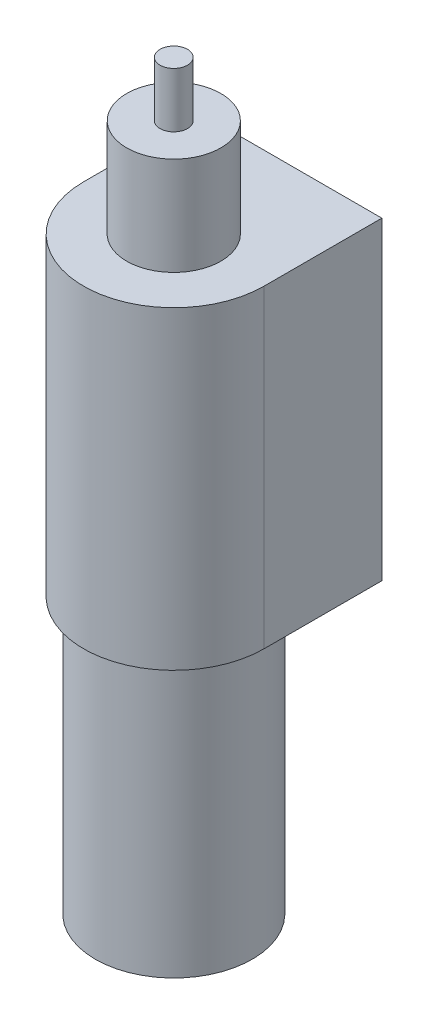
ISO-10303-21;
HEADER;
FILE_DESCRIPTION(('STEP AP214'),'2;1');
FILE_NAME('part.step','',(''),(''),'','','');
FILE_SCHEMA(('AUTOMOTIVE_DESIGN { 1 0 10303 214 1 1 1 1 }'));
ENDSEC;
DATA;
#1=APPLICATION_CONTEXT('core data for automotive mechanical design processes');
#2=APPLICATION_PROTOCOL_DEFINITION('international standard','automotive_design',2000,#1);
#3=PRODUCT_CONTEXT('',#1,'mechanical');
#4=PRODUCT('Part','Part','',(#3));
#5=PRODUCT_RELATED_PRODUCT_CATEGORY('part','',(#4));
#6=PRODUCT_DEFINITION_FORMATION('','',#4);
#7=PRODUCT_DEFINITION_CONTEXT('part definition',#1,'design');
#8=PRODUCT_DEFINITION('design','',#6,#7);
#9=PRODUCT_DEFINITION_SHAPE('','',#8);
#10=(LENGTH_UNIT() NAMED_UNIT(*) SI_UNIT(.MILLI.,.METRE.));
#11=(NAMED_UNIT(*) PLANE_ANGLE_UNIT() SI_UNIT($,.RADIAN.));
#12=(NAMED_UNIT(*) SI_UNIT($,.STERADIAN.) SOLID_ANGLE_UNIT());
#13=UNCERTAINTY_MEASURE_WITH_UNIT(LENGTH_MEASURE(1.E-05),#10,'distance_accuracy_value','');
#14=(GEOMETRIC_REPRESENTATION_CONTEXT(3) GLOBAL_UNCERTAINTY_ASSIGNED_CONTEXT((#13)) GLOBAL_UNIT_ASSIGNED_CONTEXT((#10,
#11,#12)) REPRESENTATION_CONTEXT('',''));
#15=CARTESIAN_POINT('',(0.,0.,0.));
#16=DIRECTION('',(0.,0.,1.));
#17=DIRECTION('',(1.,0.,0.));
#18=AXIS2_PLACEMENT_3D('',#15,#16,#17);
#19=CARTESIAN_POINT('',(0.,7.,0.));
#20=DIRECTION('',(0.,1.,0.));
#21=DIRECTION('',(0.,0.,1.));
#22=AXIS2_PLACEMENT_3D('',#19,#20,#21);
#23=CYLINDRICAL_SURFACE('',#22,2.3);
#24=CARTESIAN_POINT('',(0.,15.,0.));
#25=DIRECTION('',(0.,1.,0.));
#26=DIRECTION('',(0.,0.,1.));
#27=AXIS2_PLACEMENT_3D('',#24,#25,#26);
#28=CIRCLE('',#27,2.3);
#29=CARTESIAN_POINT('',(-2.3,15.,0.));
#30=VERTEX_POINT('',#29);
#31=CARTESIAN_POINT('',(2.3,15.,0.));
#32=VERTEX_POINT('',#31);
#33=EDGE_CURVE('E49',#30,#32,#28,.T.);
#34=ORIENTED_EDGE('',*,*,#33,.F.);
#35=DIRECTION('',(0.,1.,0.));
#36=VECTOR('',#35,1.);
#37=CARTESIAN_POINT('',(-2.3,1.50818791290161,0.));
#38=LINE('',#37,#36);
#39=CARTESIAN_POINT('',(-2.3,7.,0.));
#40=VERTEX_POINT('',#39);
#41=EDGE_CURVE('E102',#40,#30,#38,.T.);
#42=ORIENTED_EDGE('',*,*,#41,.F.);
#43=CARTESIAN_POINT('',(0.,7.,0.));
#44=DIRECTION('',(0.,1.,0.));
#45=DIRECTION('',(0.,0.,1.));
#46=AXIS2_PLACEMENT_3D('',#43,#44,#45);
#47=CIRCLE('',#46,2.3);
#48=CARTESIAN_POINT('',(2.3,7.,0.));
#49=VERTEX_POINT('',#48);
#50=EDGE_CURVE('E108',#40,#49,#47,.T.);
#51=ORIENTED_EDGE('',*,*,#50,.T.);
#52=DIRECTION('',(0.,1.,0.));
#53=VECTOR('',#52,1.);
#54=CARTESIAN_POINT('',(2.3,1.50818791290161,0.));
#55=LINE('',#54,#53);
#56=EDGE_CURVE('E54',#49,#32,#55,.T.);
#57=ORIENTED_EDGE('',*,*,#56,.T.);
#58=EDGE_LOOP('',(#34,#42,#51,#57));
#59=FACE_BOUND('',#58,.T.);
#60=ADVANCED_FACE('F34',(#59),#23,.T.);
#61=CARTESIAN_POINT('',(0.,15.,0.));
#62=DIRECTION('',(0.,1.,0.));
#63=DIRECTION('',(0.,0.,1.));
#64=AXIS2_PLACEMENT_3D('',#61,#62,#63);
#65=PLANE('',#64);
#66=CARTESIAN_POINT('',(0.,15.,0.));
#67=DIRECTION('',(0.,1.,0.));
#68=DIRECTION('',(0.,0.,1.));
#69=AXIS2_PLACEMENT_3D('',#66,#67,#68);
#70=CIRCLE('',#69,1.2);
#71=CARTESIAN_POINT('',(0.,15.,1.2));
#72=VERTEX_POINT('',#71);
#73=EDGE_CURVE('E117',#72,#72,#70,.T.);
#74=ORIENTED_EDGE('',*,*,#73,.F.);
#75=EDGE_LOOP('',(#74));
#76=FACE_BOUND('',#75,.T.);
#77=ORIENTED_EDGE('',*,*,#33,.T.);
#78=DIRECTION('',(0.,0.,-1.));
#79=VECTOR('',#78,1.);
#80=CARTESIAN_POINT('',(2.3,15.,0.));
#81=LINE('',#80,#79);
#82=CARTESIAN_POINT('',(2.3,15.,-3.));
#83=VERTEX_POINT('',#82);
#84=EDGE_CURVE('E79',#32,#83,#81,.T.);
#85=ORIENTED_EDGE('',*,*,#84,.T.);
#86=DIRECTION('',(1.,0.,0.));
#87=VECTOR('',#86,1.);
#88=CARTESIAN_POINT('',(0.,15.,-3.));
#89=LINE('',#88,#87);
#90=CARTESIAN_POINT('',(-2.3,15.,-3.));
#91=VERTEX_POINT('',#90);
#92=EDGE_CURVE('E87',#91,#83,#89,.T.);
#93=ORIENTED_EDGE('',*,*,#92,.F.);
#94=DIRECTION('',(0.,0.,-1.));
#95=VECTOR('',#94,1.);
#96=CARTESIAN_POINT('',(-2.3,15.,0.));
#97=LINE('',#96,#95);
#98=EDGE_CURVE('E93',#30,#91,#97,.T.);
#99=ORIENTED_EDGE('',*,*,#98,.F.);
#100=EDGE_LOOP('',(#77,#85,#93,#99));
#101=FACE_BOUND('',#100,.T.);
#102=ADVANCED_FACE('F95',(#76,#101),#65,.T.);
#103=CARTESIAN_POINT('',(0.,17.5,0.));
#104=DIRECTION('',(0.,-1.,0.));
#105=DIRECTION('',(0.,0.,-1.));
#106=AXIS2_PLACEMENT_3D('',#103,#104,#105);
#107=CYLINDRICAL_SURFACE('',#106,1.2);
#108=CARTESIAN_POINT('',(0.,17.5,0.));
#109=DIRECTION('',(0.,1.,0.));
#110=DIRECTION('',(0.,0.,1.));
#111=AXIS2_PLACEMENT_3D('',#108,#109,#110);
#112=CIRCLE('',#111,1.2);
#113=CARTESIAN_POINT('',(0.,17.5,1.2));
#114=VERTEX_POINT('',#113);
#115=EDGE_CURVE('E114',#114,#114,#112,.T.);
#116=ORIENTED_EDGE('',*,*,#115,.F.);
#117=EDGE_LOOP('',(#116));
#118=FACE_BOUND('',#117,.T.);
#119=ORIENTED_EDGE('',*,*,#73,.T.);
#120=EDGE_LOOP('',(#119));
#121=FACE_BOUND('',#120,.T.);
#122=ADVANCED_FACE('F144',(#118,#121),#107,.T.);
#123=CARTESIAN_POINT('',(0.,17.5,0.));
#124=DIRECTION('',(0.,1.,0.));
#125=DIRECTION('',(0.,0.,1.));
#126=AXIS2_PLACEMENT_3D('',#123,#124,#125);
#127=PLANE('',#126);
#128=CARTESIAN_POINT('',(0.,17.5,0.));
#129=DIRECTION('',(0.,1.,0.));
#130=DIRECTION('',(0.,0.,1.));
#131=AXIS2_PLACEMENT_3D('',#128,#129,#130);
#132=CIRCLE('',#131,0.35);
#133=CARTESIAN_POINT('',(0.,17.5,0.35));
#134=VERTEX_POINT('',#133);
#135=EDGE_CURVE('E42',#134,#134,#132,.T.);
#136=ORIENTED_EDGE('',*,*,#135,.F.);
#137=EDGE_LOOP('',(#136));
#138=FACE_BOUND('',#137,.T.);
#139=ORIENTED_EDGE('',*,*,#115,.T.);
#140=EDGE_LOOP('',(#139));
#141=FACE_BOUND('',#140,.T.);
#142=ADVANCED_FACE('F154',(#138,#141),#127,.T.);
#143=CARTESIAN_POINT('',(0.,18.9,0.));
#144=DIRECTION('',(0.,-1.,0.));
#145=DIRECTION('',(0.,0.,-1.));
#146=AXIS2_PLACEMENT_3D('',#143,#144,#145);
#147=CYLINDRICAL_SURFACE('',#146,0.35);
#148=CARTESIAN_POINT('',(0.,18.9,0.));
#149=DIRECTION('',(0.,1.,0.));
#150=DIRECTION('',(0.,0.,1.));
#151=AXIS2_PLACEMENT_3D('',#148,#149,#150);
#152=CIRCLE('',#151,0.35);
#153=CARTESIAN_POINT('',(0.,18.9,0.35));
#154=VERTEX_POINT('',#153);
#155=EDGE_CURVE('E110',#154,#154,#152,.T.);
#156=ORIENTED_EDGE('',*,*,#155,.F.);
#157=EDGE_LOOP('',(#156));
#158=FACE_BOUND('',#157,.T.);
#159=ORIENTED_EDGE('',*,*,#135,.T.);
#160=EDGE_LOOP('',(#159));
#161=FACE_BOUND('',#160,.T.);
#162=ADVANCED_FACE('F150',(#158,#161),#147,.T.);
#163=CARTESIAN_POINT('',(0.,18.9,0.));
#164=DIRECTION('',(0.,1.,0.));
#165=DIRECTION('',(0.,0.,1.));
#166=AXIS2_PLACEMENT_3D('',#163,#164,#165);
#167=PLANE('',#166);
#168=ORIENTED_EDGE('',*,*,#155,.T.);
#169=EDGE_LOOP('',(#168));
#170=FACE_BOUND('',#169,.T.);
#171=ADVANCED_FACE('F135',(#170),#167,.T.);
#172=CARTESIAN_POINT('',(0.,7.,0.));
#173=DIRECTION('',(0.,1.,0.));
#174=DIRECTION('',(0.,0.,1.));
#175=AXIS2_PLACEMENT_3D('',#172,#173,#174);
#176=PLANE('',#175);
#177=CARTESIAN_POINT('',(0.,7.,0.));
#178=DIRECTION('',(0.,1.,0.));
#179=DIRECTION('',(0.,0.,1.));
#180=AXIS2_PLACEMENT_3D('',#177,#178,#179);
#181=CIRCLE('',#180,2.);
#182=CARTESIAN_POINT('',(0.,7.,2.));
#183=VERTEX_POINT('',#182);
#184=EDGE_CURVE('E11',#183,#183,#181,.T.);
#185=ORIENTED_EDGE('',*,*,#184,.T.);
#186=EDGE_LOOP('',(#185));
#187=FACE_BOUND('',#186,.T.);
#188=ORIENTED_EDGE('',*,*,#50,.F.);
#189=DIRECTION('',(0.,0.,1.));
#190=VECTOR('',#189,1.);
#191=CARTESIAN_POINT('',(-2.3,7.,0.));
#192=LINE('',#191,#190);
#193=CARTESIAN_POINT('',(-2.3,7.,-3.));
#194=VERTEX_POINT('',#193);
#195=EDGE_CURVE('E98',#194,#40,#192,.T.);
#196=ORIENTED_EDGE('',*,*,#195,.F.);
#197=DIRECTION('',(-1.,0.,0.));
#198=VECTOR('',#197,1.);
#199=CARTESIAN_POINT('',(0.,7.,-3.));
#200=LINE('',#199,#198);
#201=CARTESIAN_POINT('',(2.3,7.,-3.));
#202=VERTEX_POINT('',#201);
#203=EDGE_CURVE('E104',#202,#194,#200,.T.);
#204=ORIENTED_EDGE('',*,*,#203,.F.);
#205=DIRECTION('',(0.,0.,1.));
#206=VECTOR('',#205,1.);
#207=CARTESIAN_POINT('',(2.3,7.,0.));
#208=LINE('',#207,#206);
#209=EDGE_CURVE('E81',#202,#49,#208,.T.);
#210=ORIENTED_EDGE('',*,*,#209,.T.);
#211=EDGE_LOOP('',(#188,#196,#204,#210));
#212=FACE_BOUND('',#211,.T.);
#213=ADVANCED_FACE('F129',(#187,#212),#176,.F.);
#214=CARTESIAN_POINT('',(0.,0.,0.));
#215=DIRECTION('',(0.,1.,0.));
#216=DIRECTION('',(0.,0.,1.));
#217=AXIS2_PLACEMENT_3D('',#214,#215,#216);
#218=PLANE('',#217);
#219=CARTESIAN_POINT('',(0.,0.,0.));
#220=DIRECTION('',(0.,1.,0.));
#221=DIRECTION('',(0.,0.,1.));
#222=AXIS2_PLACEMENT_3D('',#219,#220,#221);
#223=CIRCLE('',#222,2.);
#224=CARTESIAN_POINT('',(0.,0.,2.));
#225=VERTEX_POINT('',#224);
#226=EDGE_CURVE('E120',#225,#225,#223,.T.);
#227=ORIENTED_EDGE('',*,*,#226,.F.);
#228=EDGE_LOOP('',(#227));
#229=FACE_BOUND('',#228,.T.);
#230=ADVANCED_FACE('F127',(#229),#218,.F.);
#231=CARTESIAN_POINT('',(0.,15.,0.));
#232=DIRECTION('',(0.,-1.,0.));
#233=DIRECTION('',(0.,0.,-1.));
#234=AXIS2_PLACEMENT_3D('',#231,#232,#233);
#235=CYLINDRICAL_SURFACE('',#234,2.);
#236=ORIENTED_EDGE('',*,*,#226,.T.);
#237=EDGE_LOOP('',(#236));
#238=FACE_BOUND('',#237,.T.);
#239=ORIENTED_EDGE('',*,*,#184,.F.);
#240=EDGE_LOOP('',(#239));
#241=FACE_BOUND('',#240,.T.);
#242=ADVANCED_FACE('F36',(#238,#241),#235,.T.);
#243=CARTESIAN_POINT('',(-2.3,1.50818791290161,0.));
#244=DIRECTION('',(1.,0.,0.));
#245=DIRECTION('',(0.,0.,-1.));
#246=AXIS2_PLACEMENT_3D('',#243,#244,#245);
#247=PLANE('',#246);
#248=DIRECTION('',(0.,1.,0.));
#249=VECTOR('',#248,1.);
#250=CARTESIAN_POINT('',(-2.3,1.50818791290161,-3.));
#251=LINE('',#250,#249);
#252=EDGE_CURVE('E84',#194,#91,#251,.T.);
#253=ORIENTED_EDGE('',*,*,#252,.F.);
#254=ORIENTED_EDGE('',*,*,#195,.T.);
#255=ORIENTED_EDGE('',*,*,#41,.T.);
#256=ORIENTED_EDGE('',*,*,#98,.T.);
#257=EDGE_LOOP('',(#253,#254,#255,#256));
#258=FACE_BOUND('',#257,.T.);
#259=ADVANCED_FACE('F134',(#258),#247,.F.);
#260=CARTESIAN_POINT('',(0.,1.50818791290161,-3.));
#261=DIRECTION('',(0.,0.,1.));
#262=DIRECTION('',(1.,0.,0.));
#263=AXIS2_PLACEMENT_3D('',#260,#261,#262);
#264=PLANE('',#263);
#265=DIRECTION('',(0.,1.,0.));
#266=VECTOR('',#265,1.);
#267=CARTESIAN_POINT('',(2.3,1.50818791290161,-3.));
#268=LINE('',#267,#266);
#269=EDGE_CURVE('E75',#202,#83,#268,.T.);
#270=ORIENTED_EDGE('',*,*,#269,.F.);
#271=ORIENTED_EDGE('',*,*,#203,.T.);
#272=ORIENTED_EDGE('',*,*,#252,.T.);
#273=ORIENTED_EDGE('',*,*,#92,.T.);
#274=EDGE_LOOP('',(#270,#271,#272,#273));
#275=FACE_BOUND('',#274,.T.);
#276=ADVANCED_FACE('F88',(#275),#264,.F.);
#277=CARTESIAN_POINT('',(2.3,1.50818791290161,0.));
#278=DIRECTION('',(1.,0.,0.));
#279=DIRECTION('',(0.,0.,-1.));
#280=AXIS2_PLACEMENT_3D('',#277,#278,#279);
#281=PLANE('',#280);
#282=ORIENTED_EDGE('',*,*,#209,.F.);
#283=ORIENTED_EDGE('',*,*,#269,.T.);
#284=ORIENTED_EDGE('',*,*,#84,.F.);
#285=ORIENTED_EDGE('',*,*,#56,.F.);
#286=EDGE_LOOP('',(#282,#283,#284,#285));
#287=FACE_BOUND('',#286,.T.);
#288=ADVANCED_FACE('F77',(#287),#281,.T.);
#289=CLOSED_SHELL('',(#60,#102,#122,#142,#162,#171,#213,#230,#242,#259,#276,#288));
#290=MANIFOLD_SOLID_BREP('B2',#289);
#291=ADVANCED_BREP_SHAPE_REPRESENTATION('',(#18,#290),#14);
#292=SHAPE_DEFINITION_REPRESENTATION(#9,#291);
ENDSEC;
END-ISO-10303-21;
